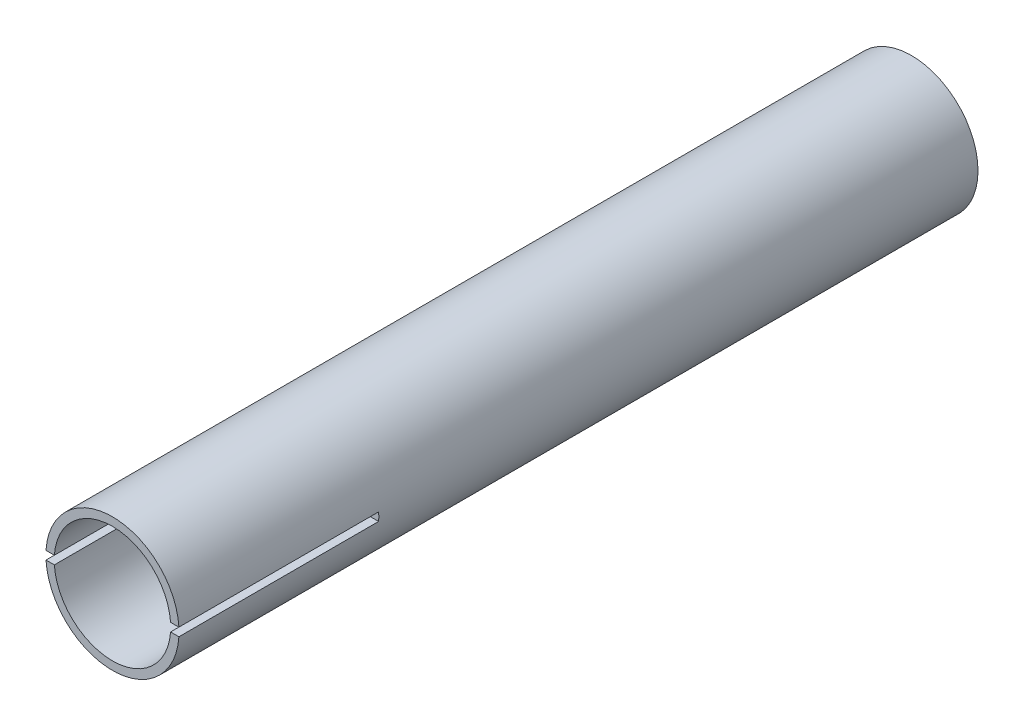
ISO-10303-21;
HEADER;
FILE_DESCRIPTION(('STEP AP214'),'2;1');
FILE_NAME('part.step','',(''),(''),'','','');
FILE_SCHEMA(('AUTOMOTIVE_DESIGN { 1 0 10303 214 1 1 1 1 }'));
ENDSEC;
DATA;
#1=APPLICATION_CONTEXT('core data for automotive mechanical design processes');
#2=APPLICATION_PROTOCOL_DEFINITION('international standard','automotive_design',2000,#1);
#3=PRODUCT_CONTEXT('',#1,'mechanical');
#4=PRODUCT('Part','Part','',(#3));
#5=PRODUCT_RELATED_PRODUCT_CATEGORY('part','',(#4));
#6=PRODUCT_DEFINITION_FORMATION('','',#4);
#7=PRODUCT_DEFINITION_CONTEXT('part definition',#1,'design');
#8=PRODUCT_DEFINITION('design','',#6,#7);
#9=PRODUCT_DEFINITION_SHAPE('','',#8);
#10=(LENGTH_UNIT() NAMED_UNIT(*) SI_UNIT(.MILLI.,.METRE.));
#11=(NAMED_UNIT(*) PLANE_ANGLE_UNIT() SI_UNIT($,.RADIAN.));
#12=(NAMED_UNIT(*) SI_UNIT($,.STERADIAN.) SOLID_ANGLE_UNIT());
#13=UNCERTAINTY_MEASURE_WITH_UNIT(LENGTH_MEASURE(1.E-05),#10,'distance_accuracy_value','');
#14=(GEOMETRIC_REPRESENTATION_CONTEXT(3) GLOBAL_UNCERTAINTY_ASSIGNED_CONTEXT((#13)) GLOBAL_UNIT_ASSIGNED_CONTEXT((#10,
#11,#12)) REPRESENTATION_CONTEXT('',''));
#15=CARTESIAN_POINT('',(0.,0.,0.));
#16=DIRECTION('',(0.,0.,1.));
#17=DIRECTION('',(1.,0.,0.));
#18=AXIS2_PLACEMENT_3D('',#15,#16,#17);
#19=CARTESIAN_POINT('',(0.,0.,152.4));
#20=DIRECTION('',(0.,0.,1.));
#21=DIRECTION('',(1.,0.,0.));
#22=AXIS2_PLACEMENT_3D('',#19,#20,#21);
#23=PLANE('',#22);
#24=DIRECTION('',(1.,0.,0.));
#25=VECTOR('',#24,1.);
#26=CARTESIAN_POINT('',(-12.701,-0.793750000000005,152.4));
#27=LINE('',#26,#25);
#28=CARTESIAN_POINT('',(-12.6751710417454,-0.793750000000005,152.4));
#29=VERTEX_POINT('',#28);
#30=CARTESIAN_POINT('',(-11.0841155347416,-0.793750000000005,152.4));
#31=VERTEX_POINT('',#30);
#32=EDGE_CURVE('E105',#29,#31,#27,.T.);
#33=ORIENTED_EDGE('',*,*,#32,.F.);
#34=CARTESIAN_POINT('',(0.,0.,152.4));
#35=DIRECTION('',(0.,0.,1.));
#36=DIRECTION('',(1.,0.,0.));
#37=AXIS2_PLACEMENT_3D('',#34,#35,#36);
#38=CIRCLE('',#37,12.7);
#39=CARTESIAN_POINT('',(12.6751710417454,-0.793750000000005,152.4));
#40=VERTEX_POINT('',#39);
#41=EDGE_CURVE('E32',#29,#40,#38,.T.);
#42=ORIENTED_EDGE('',*,*,#41,.T.);
#43=DIRECTION('',(-1.,0.,0.));
#44=VECTOR('',#43,1.);
#45=CARTESIAN_POINT('',(12.701,-0.793750000000005,152.4));
#46=LINE('',#45,#44);
#47=CARTESIAN_POINT('',(11.0841155347416,-0.793750000000005,152.4));
#48=VERTEX_POINT('',#47);
#49=EDGE_CURVE('E131',#40,#48,#46,.T.);
#50=ORIENTED_EDGE('',*,*,#49,.T.);
#51=CARTESIAN_POINT('',(0.,0.,152.4));
#52=DIRECTION('',(0.,0.,1.));
#53=DIRECTION('',(1.,0.,0.));
#54=AXIS2_PLACEMENT_3D('',#51,#52,#53);
#55=CIRCLE('',#54,11.1125);
#56=EDGE_CURVE('E114',#31,#48,#55,.T.);
#57=ORIENTED_EDGE('',*,*,#56,.F.);
#58=EDGE_LOOP('',(#33,#42,#50,#57));
#59=FACE_BOUND('',#58,.T.);
#60=ADVANCED_FACE('F24',(#59),#23,.T.);
#61=DIRECTION('',(1.,0.,0.));
#62=VECTOR('',#61,1.);
#63=CARTESIAN_POINT('',(-12.701,0.793750000000005,152.4));
#64=LINE('',#63,#62);
#65=CARTESIAN_POINT('',(-12.6751710417454,0.793750000000005,152.4));
#66=VERTEX_POINT('',#65);
#67=CARTESIAN_POINT('',(-11.0841155347416,0.793750000000005,152.4));
#68=VERTEX_POINT('',#67);
#69=EDGE_CURVE('E91',#66,#68,#64,.T.);
#70=ORIENTED_EDGE('',*,*,#69,.T.);
#71=CARTESIAN_POINT('',(11.0841155347416,0.793750000000005,152.4));
#72=VERTEX_POINT('',#71);
#73=EDGE_CURVE('E103',#72,#68,#55,.T.);
#74=ORIENTED_EDGE('',*,*,#73,.F.);
#75=DIRECTION('',(-1.,0.,0.));
#76=VECTOR('',#75,1.);
#77=CARTESIAN_POINT('',(12.701,0.793750000000005,152.4));
#78=LINE('',#77,#76);
#79=CARTESIAN_POINT('',(12.6751710417454,0.793750000000005,152.4));
#80=VERTEX_POINT('',#79);
#81=EDGE_CURVE('E129',#80,#72,#78,.T.);
#82=ORIENTED_EDGE('',*,*,#81,.F.);
#83=EDGE_CURVE('E11',#80,#66,#38,.T.);
#84=ORIENTED_EDGE('',*,*,#83,.T.);
#85=EDGE_LOOP('',(#70,#74,#82,#84));
#86=FACE_BOUND('',#85,.T.);
#87=ADVANCED_FACE('F101',(#86),#23,.T.);
#88=CARTESIAN_POINT('',(0.,0.,152.4));
#89=DIRECTION('',(0.,0.,-1.));
#90=DIRECTION('',(-1.,0.,0.));
#91=AXIS2_PLACEMENT_3D('',#88,#89,#90);
#92=CYLINDRICAL_SURFACE('',#91,12.7);
#93=CARTESIAN_POINT('',(0.,0.,0.));
#94=DIRECTION('',(0.,0.,1.));
#95=DIRECTION('',(1.,0.,0.));
#96=AXIS2_PLACEMENT_3D('',#93,#94,#95);
#97=CIRCLE('',#96,12.7);
#98=CARTESIAN_POINT('',(12.7,0.,0.));
#99=VERTEX_POINT('',#98);
#100=EDGE_CURVE('E113',#99,#99,#97,.T.);
#101=ORIENTED_EDGE('',*,*,#100,.T.);
#102=EDGE_LOOP('',(#101));
#103=FACE_BOUND('',#102,.T.);
#104=ORIENTED_EDGE('',*,*,#41,.F.);
#105=DIRECTION('',(0.,0.,-1.));
#106=VECTOR('',#105,1.);
#107=CARTESIAN_POINT('',(-12.6751710417454,-0.793750000000005,152.4));
#108=LINE('',#107,#106);
#109=CARTESIAN_POINT('',(-12.6751710417454,-0.793749999999991,114.3));
#110=VERTEX_POINT('',#109);
#111=EDGE_CURVE('E145',#110,#29,#108,.F.);
#112=ORIENTED_EDGE('',*,*,#111,.F.);
#113=CARTESIAN_POINT('',(0.,0.,114.3));
#114=DIRECTION('',(0.,0.,-1.));
#115=DIRECTION('',(-1.,0.,0.));
#116=AXIS2_PLACEMENT_3D('',#113,#114,#115);
#117=CIRCLE('',#116,12.7);
#118=CARTESIAN_POINT('',(-12.6751710417454,0.793750000000005,114.3));
#119=VERTEX_POINT('',#118);
#120=EDGE_CURVE('E151',#119,#110,#117,.F.);
#121=ORIENTED_EDGE('',*,*,#120,.F.);
#122=DIRECTION('',(0.,0.,-1.));
#123=VECTOR('',#122,1.);
#124=CARTESIAN_POINT('',(-12.6751710417454,0.793750000000005,152.4));
#125=LINE('',#124,#123);
#126=EDGE_CURVE('E96',#66,#119,#125,.T.);
#127=ORIENTED_EDGE('',*,*,#126,.F.);
#128=ORIENTED_EDGE('',*,*,#83,.F.);
#129=DIRECTION('',(0.,0.,-1.));
#130=VECTOR('',#129,1.);
#131=CARTESIAN_POINT('',(12.6751710417454,0.793750000000005,152.4));
#132=LINE('',#131,#130);
#133=CARTESIAN_POINT('',(12.6751710417454,0.793750000000009,114.3));
#134=VERTEX_POINT('',#133);
#135=EDGE_CURVE('E136',#80,#134,#132,.T.);
#136=ORIENTED_EDGE('',*,*,#135,.T.);
#137=CARTESIAN_POINT('',(0.,0.,114.3));
#138=DIRECTION('',(0.,0.,1.));
#139=DIRECTION('',(1.,0.,0.));
#140=AXIS2_PLACEMENT_3D('',#137,#138,#139);
#141=CIRCLE('',#140,12.7);
#142=CARTESIAN_POINT('',(12.6751710417454,-0.793750000000005,114.3));
#143=VERTEX_POINT('',#142);
#144=EDGE_CURVE('E139',#134,#143,#141,.F.);
#145=ORIENTED_EDGE('',*,*,#144,.T.);
#146=DIRECTION('',(0.,0.,-1.));
#147=VECTOR('',#146,1.);
#148=CARTESIAN_POINT('',(12.6751710417454,-0.793750000000005,152.4));
#149=LINE('',#148,#147);
#150=EDGE_CURVE('E121',#143,#40,#149,.F.);
#151=ORIENTED_EDGE('',*,*,#150,.T.);
#152=EDGE_LOOP('',(#104,#112,#121,#127,#128,#136,#145,#151));
#153=FACE_BOUND('',#152,.T.);
#154=ADVANCED_FACE('F26',(#103,#153),#92,.T.);
#155=CARTESIAN_POINT('',(0.,0.,152.4));
#156=DIRECTION('',(0.,0.,-1.));
#157=DIRECTION('',(-1.,0.,0.));
#158=AXIS2_PLACEMENT_3D('',#155,#156,#157);
#159=CYLINDRICAL_SURFACE('',#158,11.1125);
#160=DIRECTION('',(0.,0.,-1.));
#161=VECTOR('',#160,1.);
#162=CARTESIAN_POINT('',(-11.0841155347416,-0.793750000000005,152.4));
#163=LINE('',#162,#161);
#164=CARTESIAN_POINT('',(-11.0841155347416,-0.793749999999991,114.3));
#165=VERTEX_POINT('',#164);
#166=EDGE_CURVE('E154',#165,#31,#163,.F.);
#167=ORIENTED_EDGE('',*,*,#166,.T.);
#168=ORIENTED_EDGE('',*,*,#56,.T.);
#169=DIRECTION('',(0.,0.,-1.));
#170=VECTOR('',#169,1.);
#171=CARTESIAN_POINT('',(11.0841155347416,-0.793750000000005,152.4));
#172=LINE('',#171,#170);
#173=CARTESIAN_POINT('',(11.0841155347416,-0.793750000000005,114.3));
#174=VERTEX_POINT('',#173);
#175=EDGE_CURVE('E124',#174,#48,#172,.F.);
#176=ORIENTED_EDGE('',*,*,#175,.F.);
#177=CARTESIAN_POINT('',(0.,0.,114.3));
#178=DIRECTION('',(0.,0.,1.));
#179=DIRECTION('',(1.,0.,0.));
#180=AXIS2_PLACEMENT_3D('',#177,#178,#179);
#181=CIRCLE('',#180,11.1125);
#182=CARTESIAN_POINT('',(11.0841155347416,0.793750000000009,114.3));
#183=VERTEX_POINT('',#182);
#184=EDGE_CURVE('E47',#183,#174,#181,.F.);
#185=ORIENTED_EDGE('',*,*,#184,.F.);
#186=DIRECTION('',(0.,0.,-1.));
#187=VECTOR('',#186,1.);
#188=CARTESIAN_POINT('',(11.0841155347416,0.793750000000005,152.4));
#189=LINE('',#188,#187);
#190=EDGE_CURVE('E112',#72,#183,#189,.T.);
#191=ORIENTED_EDGE('',*,*,#190,.F.);
#192=ORIENTED_EDGE('',*,*,#73,.T.);
#193=DIRECTION('',(0.,0.,-1.));
#194=VECTOR('',#193,1.);
#195=CARTESIAN_POINT('',(-11.0841155347416,0.793750000000005,152.4));
#196=LINE('',#195,#194);
#197=CARTESIAN_POINT('',(-11.0841155347416,0.793750000000005,114.3));
#198=VERTEX_POINT('',#197);
#199=EDGE_CURVE('E88',#68,#198,#196,.T.);
#200=ORIENTED_EDGE('',*,*,#199,.T.);
#201=CARTESIAN_POINT('',(0.,0.,114.3));
#202=DIRECTION('',(0.,0.,-1.));
#203=DIRECTION('',(-1.,0.,0.));
#204=AXIS2_PLACEMENT_3D('',#201,#202,#203);
#205=CIRCLE('',#204,11.1125);
#206=EDGE_CURVE('E156',#198,#165,#205,.F.);
#207=ORIENTED_EDGE('',*,*,#206,.T.);
#208=EDGE_LOOP('',(#167,#168,#176,#185,#191,#192,#200,#207));
#209=FACE_BOUND('',#208,.T.);
#210=CARTESIAN_POINT('',(0.,0.,0.));
#211=DIRECTION('',(0.,0.,1.));
#212=DIRECTION('',(1.,0.,0.));
#213=AXIS2_PLACEMENT_3D('',#210,#211,#212);
#214=CIRCLE('',#213,11.1125);
#215=CARTESIAN_POINT('',(11.1125,0.,0.));
#216=VERTEX_POINT('',#215);
#217=EDGE_CURVE('E117',#216,#216,#214,.T.);
#218=ORIENTED_EDGE('',*,*,#217,.F.);
#219=EDGE_LOOP('',(#218));
#220=FACE_BOUND('',#219,.T.);
#221=ADVANCED_FACE('F109',(#209,#220),#159,.F.);
#222=CARTESIAN_POINT('',(0.,0.,0.));
#223=DIRECTION('',(0.,0.,1.));
#224=DIRECTION('',(1.,0.,0.));
#225=AXIS2_PLACEMENT_3D('',#222,#223,#224);
#226=PLANE('',#225);
#227=ORIENTED_EDGE('',*,*,#100,.F.);
#228=EDGE_LOOP('',(#227));
#229=FACE_BOUND('',#228,.T.);
#230=ORIENTED_EDGE('',*,*,#217,.T.);
#231=EDGE_LOOP('',(#230));
#232=FACE_BOUND('',#231,.T.);
#233=ADVANCED_FACE('F183',(#229,#232),#226,.F.);
#234=CARTESIAN_POINT('',(12.701,0.793750000000009,114.3));
#235=DIRECTION('',(0.,0.,1.));
#236=DIRECTION('',(1.,0.,0.));
#237=AXIS2_PLACEMENT_3D('',#234,#235,#236);
#238=PLANE('',#237);
#239=DIRECTION('',(-1.,0.,0.));
#240=VECTOR('',#239,1.);
#241=CARTESIAN_POINT('',(12.701,0.793750000000009,114.3));
#242=LINE('',#241,#240);
#243=EDGE_CURVE('E127',#134,#183,#242,.T.);
#244=ORIENTED_EDGE('',*,*,#243,.T.);
#245=ORIENTED_EDGE('',*,*,#184,.T.);
#246=DIRECTION('',(-1.,0.,0.));
#247=VECTOR('',#246,1.);
#248=CARTESIAN_POINT('',(12.701,-0.793749999999991,114.3));
#249=LINE('',#248,#247);
#250=EDGE_CURVE('E134',#143,#174,#249,.T.);
#251=ORIENTED_EDGE('',*,*,#250,.F.);
#252=ORIENTED_EDGE('',*,*,#144,.F.);
#253=EDGE_LOOP('',(#244,#245,#251,#252));
#254=FACE_BOUND('',#253,.T.);
#255=ADVANCED_FACE('F172',(#254),#238,.T.);
#256=CARTESIAN_POINT('',(12.701,0.793750000000009,114.3));
#257=DIRECTION('',(0.,-1.,0.));
#258=DIRECTION('',(0.,0.,-1.));
#259=AXIS2_PLACEMENT_3D('',#256,#257,#258);
#260=PLANE('',#259);
#261=ORIENTED_EDGE('',*,*,#81,.T.);
#262=ORIENTED_EDGE('',*,*,#190,.T.);
#263=ORIENTED_EDGE('',*,*,#243,.F.);
#264=ORIENTED_EDGE('',*,*,#135,.F.);
#265=EDGE_LOOP('',(#261,#262,#263,#264));
#266=FACE_BOUND('',#265,.T.);
#267=ADVANCED_FACE('F175',(#266),#260,.T.);
#268=CARTESIAN_POINT('',(12.701,-0.793749999999991,114.3));
#269=DIRECTION('',(0.,1.,0.));
#270=DIRECTION('',(0.,0.,1.));
#271=AXIS2_PLACEMENT_3D('',#268,#269,#270);
#272=PLANE('',#271);
#273=ORIENTED_EDGE('',*,*,#250,.T.);
#274=ORIENTED_EDGE('',*,*,#175,.T.);
#275=ORIENTED_EDGE('',*,*,#49,.F.);
#276=ORIENTED_EDGE('',*,*,#150,.F.);
#277=EDGE_LOOP('',(#273,#274,#275,#276));
#278=FACE_BOUND('',#277,.T.);
#279=ADVANCED_FACE('F170',(#278),#272,.T.);
#280=CARTESIAN_POINT('',(-12.701,0.793750000000009,114.3));
#281=DIRECTION('',(0.,0.,-1.));
#282=DIRECTION('',(-1.,0.,0.));
#283=AXIS2_PLACEMENT_3D('',#280,#281,#282);
#284=PLANE('',#283);
#285=ORIENTED_EDGE('',*,*,#120,.T.);
#286=DIRECTION('',(1.,0.,0.));
#287=VECTOR('',#286,1.);
#288=CARTESIAN_POINT('',(-12.701,-0.793749999999991,114.3));
#289=LINE('',#288,#287);
#290=EDGE_CURVE('E97',#110,#165,#289,.T.);
#291=ORIENTED_EDGE('',*,*,#290,.T.);
#292=ORIENTED_EDGE('',*,*,#206,.F.);
#293=DIRECTION('',(1.,0.,0.));
#294=VECTOR('',#293,1.);
#295=CARTESIAN_POINT('',(-12.701,0.793750000000009,114.3));
#296=LINE('',#295,#294);
#297=EDGE_CURVE('E39',#119,#198,#296,.T.);
#298=ORIENTED_EDGE('',*,*,#297,.F.);
#299=EDGE_LOOP('',(#285,#291,#292,#298));
#300=FACE_BOUND('',#299,.T.);
#301=ADVANCED_FACE('F159',(#300),#284,.F.);
#302=CARTESIAN_POINT('',(-12.701,-0.793749999999991,114.3));
#303=DIRECTION('',(0.,-1.,0.));
#304=DIRECTION('',(0.,0.,-1.));
#305=AXIS2_PLACEMENT_3D('',#302,#303,#304);
#306=PLANE('',#305);
#307=ORIENTED_EDGE('',*,*,#111,.T.);
#308=ORIENTED_EDGE('',*,*,#32,.T.);
#309=ORIENTED_EDGE('',*,*,#166,.F.);
#310=ORIENTED_EDGE('',*,*,#290,.F.);
#311=EDGE_LOOP('',(#307,#308,#309,#310));
#312=FACE_BOUND('',#311,.T.);
#313=ADVANCED_FACE('F163',(#312),#306,.F.);
#314=CARTESIAN_POINT('',(-12.701,0.793750000000009,114.3));
#315=DIRECTION('',(0.,1.,0.));
#316=DIRECTION('',(0.,0.,1.));
#317=AXIS2_PLACEMENT_3D('',#314,#315,#316);
#318=PLANE('',#317);
#319=ORIENTED_EDGE('',*,*,#126,.T.);
#320=ORIENTED_EDGE('',*,*,#297,.T.);
#321=ORIENTED_EDGE('',*,*,#199,.F.);
#322=ORIENTED_EDGE('',*,*,#69,.F.);
#323=EDGE_LOOP('',(#319,#320,#321,#322));
#324=FACE_BOUND('',#323,.T.);
#325=ADVANCED_FACE('F90',(#324),#318,.F.);
#326=CLOSED_SHELL('',(#60,#87,#154,#221,#233,#255,#267,#279,#301,#313,#325));
#327=MANIFOLD_SOLID_BREP('B2',#326);
#328=ADVANCED_BREP_SHAPE_REPRESENTATION('',(#18,#327),#14);
#329=SHAPE_DEFINITION_REPRESENTATION(#9,#328);
ENDSEC;
END-ISO-10303-21;
